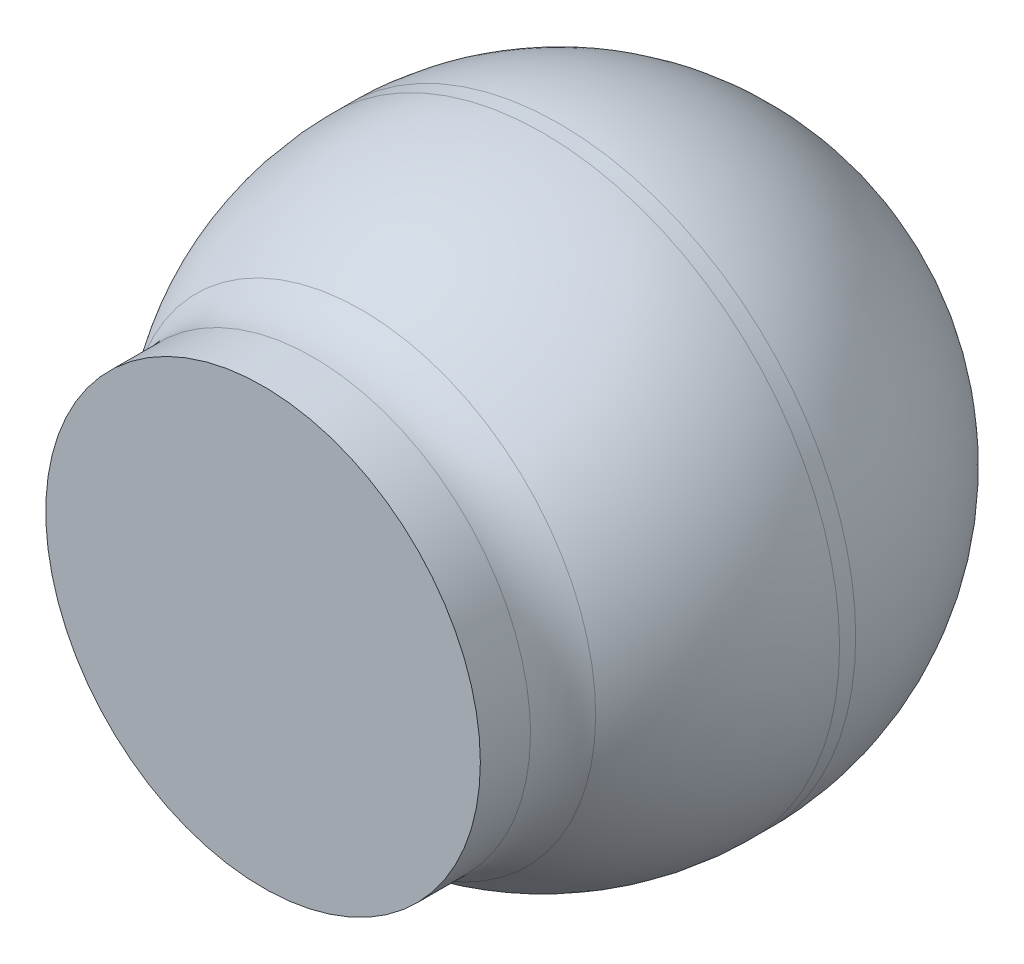
ISO-10303-21;
HEADER;
FILE_DESCRIPTION(('STEP AP214'),'2;1');
FILE_NAME('part.step','',(''),(''),'','','');
FILE_SCHEMA(('AUTOMOTIVE_DESIGN { 1 0 10303 214 1 1 1 1 }'));
ENDSEC;
DATA;
#1=APPLICATION_CONTEXT('core data for automotive mechanical design processes');
#2=APPLICATION_PROTOCOL_DEFINITION('international standard','automotive_design',2000,#1);
#3=PRODUCT_CONTEXT('',#1,'mechanical');
#4=PRODUCT('Part','Part','',(#3));
#5=PRODUCT_RELATED_PRODUCT_CATEGORY('part','',(#4));
#6=PRODUCT_DEFINITION_FORMATION('','',#4);
#7=PRODUCT_DEFINITION_CONTEXT('part definition',#1,'design');
#8=PRODUCT_DEFINITION('design','',#6,#7);
#9=PRODUCT_DEFINITION_SHAPE('','',#8);
#10=(LENGTH_UNIT() NAMED_UNIT(*) SI_UNIT(.MILLI.,.METRE.));
#11=(NAMED_UNIT(*) PLANE_ANGLE_UNIT() SI_UNIT($,.RADIAN.));
#12=(NAMED_UNIT(*) SI_UNIT($,.STERADIAN.) SOLID_ANGLE_UNIT());
#13=UNCERTAINTY_MEASURE_WITH_UNIT(LENGTH_MEASURE(1.E-05),#10,'distance_accuracy_value','');
#14=(GEOMETRIC_REPRESENTATION_CONTEXT(3) GLOBAL_UNCERTAINTY_ASSIGNED_CONTEXT((#13)) GLOBAL_UNIT_ASSIGNED_CONTEXT((#10,
#11,#12)) REPRESENTATION_CONTEXT('',''));
#15=CARTESIAN_POINT('',(0.,0.,0.));
#16=DIRECTION('',(0.,0.,1.));
#17=DIRECTION('',(1.,0.,0.));
#18=AXIS2_PLACEMENT_3D('',#15,#16,#17);
#19=CARTESIAN_POINT('',(1.977080077731,-6.591349291452,10.006534503384));
#20=DIRECTION('',(0.,0.,-1.));
#21=DIRECTION('',(-1.,0.,0.));
#22=AXIS2_PLACEMENT_3D('',#19,#20,#21);
#23=PLANE('',#22);
#24=CARTESIAN_POINT('',(1.977080077731,-6.591349291452,10.006534503384));
#25=DIRECTION('',(0.,0.,1.));
#26=DIRECTION('',(1.,0.,0.));
#27=AXIS2_PLACEMENT_3D('',#24,#25,#26);
#28=CIRCLE('',#27,0.275);
#29=CARTESIAN_POINT('',(2.252080077731,-6.591349291452,10.006534503384));
#30=VERTEX_POINT('',#29);
#31=EDGE_CURVE('E20',#30,#30,#28,.F.);
#32=ORIENTED_EDGE('',*,*,#31,.F.);
#33=EDGE_LOOP('',(#32));
#34=FACE_BOUND('',#33,.T.);
#35=ADVANCED_FACE('F17',(#34),#23,.F.);
#36=CARTESIAN_POINT('',(1.977080077731,-6.591349291452,9.906534503384));
#37=DIRECTION('',(0.,0.,1.));
#38=DIRECTION('',(1.,0.,0.));
#39=AXIS2_PLACEMENT_3D('',#36,#37,#38);
#40=CYLINDRICAL_SURFACE('',#39,0.275);
#41=CARTESIAN_POINT('',(1.977080077731,-6.591349291452,9.943180457728));
#42=DIRECTION('',(0.,0.,-1.));
#43=DIRECTION('',(0.996700902337583,0.0811622527992439,0.));
#44=AXIS2_PLACEMENT_3D('',#41,#42,#43);
#45=CIRCLE('',#44,0.275);
#46=CARTESIAN_POINT('',(2.25117282587384,-6.56902967193221,9.943180457728));
#47=VERTEX_POINT('',#46);
#48=EDGE_CURVE('E65',#47,#47,#45,.F.);
#49=ORIENTED_EDGE('',*,*,#48,.T.);
#50=EDGE_LOOP('',(#49));
#51=FACE_BOUND('',#50,.T.);
#52=ORIENTED_EDGE('',*,*,#31,.T.);
#53=EDGE_LOOP('',(#52));
#54=FACE_BOUND('',#53,.T.);
#55=ADVANCED_FACE('F62',(#51,#54),#40,.T.);
#56=CARTESIAN_POINT('',(1.977080077731,-6.591349291452,9.943180457728));
#57=DIRECTION('',(0.,0.,-1.));
#58=DIRECTION('',(0.996700902337583,0.0811622527992448,0.));
#59=AXIS2_PLACEMENT_3D('',#56,#57,#58);
#60=TOROIDAL_SURFACE('',#59,0.375,0.1);
#61=ORIENTED_EDGE('',*,*,#48,.F.);
#62=EDGE_LOOP('',(#61));
#63=FACE_BOUND('',#62,.T.);
#64=CARTESIAN_POINT('',(1.977080077731,-6.591349291452,9.881744931236));
#65=DIRECTION('',(0.,0.,-1.));
#66=DIRECTION('',(-0.996700902337598,-0.0811622527990593,0.));
#67=AXIS2_PLACEMENT_3D('',#64,#65,#66);
#68=CIRCLE('',#67,0.296097046412665);
#69=CARTESIAN_POINT('',(1.681959884392,-6.615381194786,9.881744931236));
#70=VERTEX_POINT('',#69);
#71=EDGE_CURVE('E39',#70,#70,#68,.T.);
#72=ORIENTED_EDGE('',*,*,#71,.F.);
#73=EDGE_LOOP('',(#72));
#74=FACE_BOUND('',#73,.T.);
#75=ADVANCED_FACE('F57',(#63,#74),#60,.F.);
#76=CARTESIAN_POINT('',(1.603317239355,-6.621785136252,9.651976062157));
#77=CARTESIAN_POINT('',(1.603317239355,-6.621785136252,9.701461392103));
#78=CARTESIAN_POINT('',(1.611473782652,-6.621120941579,9.750947004335));
#79=CARTESIAN_POINT('',(1.627792914651,-6.619792059952,9.798626332798));
#80=CARTESIAN_POINT('',(1.651658609162,-6.617848654938,9.842699544317));
#81=CARTESIAN_POINT('',(1.681959884392,-6.615381194786,9.881744931236));
#82=(BOUNDED_CURVE() B_SPLINE_CURVE(5,(#76,#77,#78,#79,#80,#81),.UNSPECIFIED.,.F.,
.F.) B_SPLINE_CURVE_WITH_KNOTS((6,6),(0.,0.661568582165),
.UNSPECIFIED.) CURVE() GEOMETRIC_REPRESENTATION_ITEM() RATIONAL_B_SPLINE_CURVE((1.,1.,1.,1.,1.,1.)) REPRESENTATION_ITEM(''));
#83=CARTESIAN_POINT('',(1.977080077731,-6.591349291452,9.651976062157));
#84=DIRECTION('',(0.,0.,-1.));
#85=AXIS1_PLACEMENT('',#83,#84);
#86=SURFACE_OF_REVOLUTION('',#82,#85);
#87=CARTESIAN_POINT('',(1.977080077731,-6.591349291452,9.651976062157));
#88=DIRECTION('',(0.,0.,1.));
#89=DIRECTION('',(1.,0.,0.));
#90=AXIS2_PLACEMENT_3D('',#87,#88,#89);
#91=CIRCLE('',#90,0.375);
#92=CARTESIAN_POINT('',(2.352080077731,-6.591349291452,9.651976062157));
#93=VERTEX_POINT('',#92);
#94=EDGE_CURVE('E36',#93,#93,#91,.F.);
#95=ORIENTED_EDGE('',*,*,#94,.F.);
#96=EDGE_LOOP('',(#95));
#97=FACE_BOUND('',#96,.T.);
#98=ORIENTED_EDGE('',*,*,#71,.T.);
#99=EDGE_LOOP('',(#98));
#100=FACE_BOUND('',#99,.T.);
#101=ADVANCED_FACE('F53',(#97,#100),#86,.F.);
#102=CARTESIAN_POINT('',(1.977080077731,-6.591349291452,9.256534503384));
#103=DIRECTION('',(0.,0.,1.));
#104=DIRECTION('',(1.,0.,0.));
#105=AXIS2_PLACEMENT_3D('',#102,#103,#104);
#106=CYLINDRICAL_SURFACE('',#105,0.375);
#107=CARTESIAN_POINT('',(1.977080077731,-6.591349291452,9.631534503384));
#108=DIRECTION('',(0.,0.,-1.));
#109=DIRECTION('',(0.0811622527992357,-0.996700902337583,0.));
#110=AXIS2_PLACEMENT_3D('',#107,#108,#109);
#111=CIRCLE('',#110,0.375);
#112=CARTESIAN_POINT('',(2.00751592253071,-6.96511212982859,9.631534503384));
#113=VERTEX_POINT('',#112);
#114=CARTESIAN_POINT('',(1.94664423293129,-6.21758645307541,9.631534503384));
#115=VERTEX_POINT('',#114);
#116=EDGE_CURVE('E11',#113,#115,#111,.T.);
#117=ORIENTED_EDGE('',*,*,#116,.F.);
#118=CARTESIAN_POINT('',(1.977080077731,-6.591349291452,9.631534503384));
#119=DIRECTION('',(0.,0.,1.));
#120=DIRECTION('',(0.0811622527992365,-0.996700902337583,0.));
#121=AXIS2_PLACEMENT_3D('',#118,#119,#120);
#122=CIRCLE('',#121,0.375);
#123=EDGE_CURVE('E25',#115,#113,#122,.F.);
#124=ORIENTED_EDGE('',*,*,#123,.F.);
#125=EDGE_LOOP('',(#117,#124));
#126=FACE_BOUND('',#125,.T.);
#127=ORIENTED_EDGE('',*,*,#94,.T.);
#128=EDGE_LOOP('',(#127));
#129=FACE_BOUND('',#128,.T.);
#130=ADVANCED_FACE('F34',(#126,#129),#106,.T.);
#131=CARTESIAN_POINT('',(1.977080077731,-6.591349291452,9.631534503384));
#132=DIRECTION('',(0.0811622527992361,-0.996700902337583,0.));
#133=DIRECTION('',(-0.996700902337583,-0.0811622527992361,0.));
#134=AXIS2_PLACEMENT_3D('',#131,#132,#133);
#135=SPHERICAL_SURFACE('',#134,0.375);
#136=ORIENTED_EDGE('',*,*,#123,.T.);
#137=ORIENTED_EDGE('',*,*,#116,.T.);
#138=EDGE_LOOP('',(#136,#137));
#139=FACE_BOUND('',#138,.T.);
#140=ADVANCED_FACE('F32',(#139),#135,.T.);
#141=CLOSED_SHELL('',(#35,#55,#75,#101,#130,#140));
#142=MANIFOLD_SOLID_BREP('B1',#141);
#143=ADVANCED_BREP_SHAPE_REPRESENTATION('',(#18,#142),#14);
#144=SHAPE_DEFINITION_REPRESENTATION(#9,#143);
ENDSEC;
END-ISO-10303-21;
